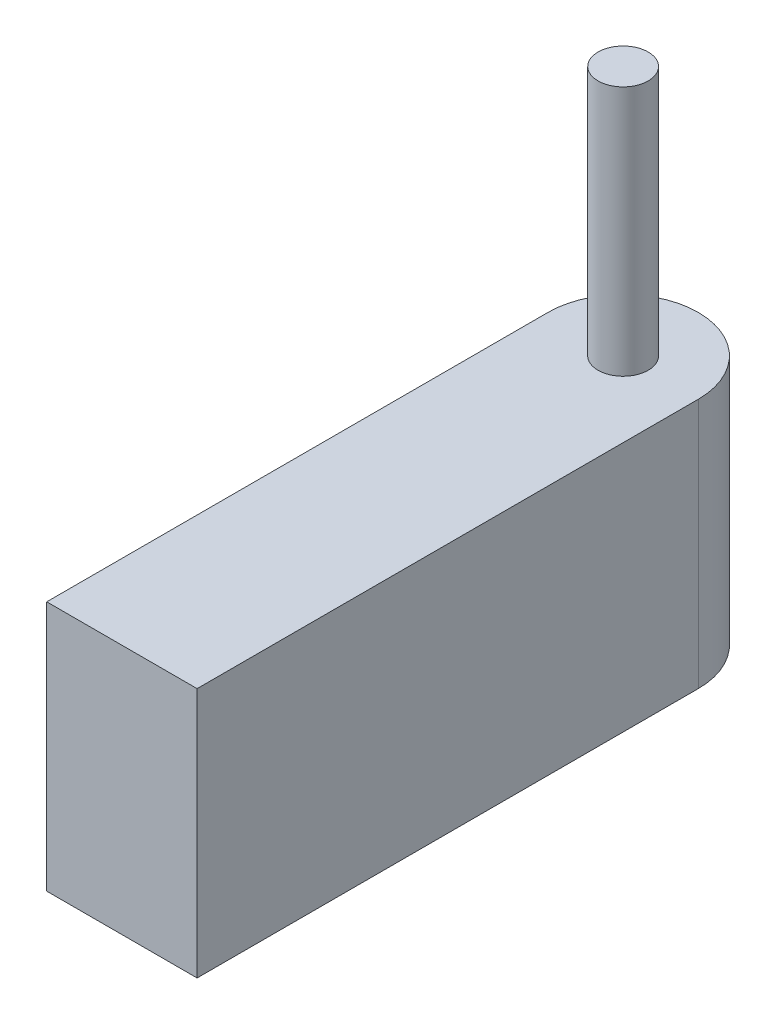
ISO-10303-21;
HEADER;
FILE_DESCRIPTION(('STEP AP214'),'2;1');
FILE_NAME('part.step','',(''),(''),'','','');
FILE_SCHEMA(('AUTOMOTIVE_DESIGN { 1 0 10303 214 1 1 1 1 }'));
ENDSEC;
DATA;
#1=APPLICATION_CONTEXT('core data for automotive mechanical design processes');
#2=APPLICATION_PROTOCOL_DEFINITION('international standard','automotive_design',2000,#1);
#3=PRODUCT_CONTEXT('',#1,'mechanical');
#4=PRODUCT('Part','Part','',(#3));
#5=PRODUCT_RELATED_PRODUCT_CATEGORY('part','',(#4));
#6=PRODUCT_DEFINITION_FORMATION('','',#4);
#7=PRODUCT_DEFINITION_CONTEXT('part definition',#1,'design');
#8=PRODUCT_DEFINITION('design','',#6,#7);
#9=PRODUCT_DEFINITION_SHAPE('','',#8);
#10=(LENGTH_UNIT() NAMED_UNIT(*) SI_UNIT(.MILLI.,.METRE.));
#11=(NAMED_UNIT(*) PLANE_ANGLE_UNIT() SI_UNIT($,.RADIAN.));
#12=(NAMED_UNIT(*) SI_UNIT($,.STERADIAN.) SOLID_ANGLE_UNIT());
#13=UNCERTAINTY_MEASURE_WITH_UNIT(LENGTH_MEASURE(1.E-05),#10,'distance_accuracy_value','');
#14=(GEOMETRIC_REPRESENTATION_CONTEXT(3) GLOBAL_UNCERTAINTY_ASSIGNED_CONTEXT((#13)) GLOBAL_UNIT_ASSIGNED_CONTEXT((#10,
#11,#12)) REPRESENTATION_CONTEXT('',''));
#15=CARTESIAN_POINT('',(0.,0.,0.));
#16=DIRECTION('',(0.,0.,1.));
#17=DIRECTION('',(1.,0.,0.));
#18=AXIS2_PLACEMENT_3D('',#15,#16,#17);
#19=CARTESIAN_POINT('',(0.,1.27,-1.27));
#20=DIRECTION('',(0.,-1.,0.));
#21=DIRECTION('',(0.,0.,-1.));
#22=AXIS2_PLACEMENT_3D('',#19,#20,#21);
#23=CYLINDRICAL_SURFACE('',#22,0.381);
#24=CARTESIAN_POINT('',(0.,0.,-1.27));
#25=DIRECTION('',(0.,1.,0.));
#26=DIRECTION('',(0.,0.,1.));
#27=AXIS2_PLACEMENT_3D('',#24,#25,#26);
#28=CIRCLE('',#27,0.381);
#29=CARTESIAN_POINT('',(0.381,0.,-1.27));
#30=VERTEX_POINT('',#29);
#31=CARTESIAN_POINT('',(-0.381,0.,-1.27));
#32=VERTEX_POINT('',#31);
#33=EDGE_CURVE('E111',#30,#32,#28,.T.);
#34=ORIENTED_EDGE('',*,*,#33,.T.);
#35=DIRECTION('',(0.,-1.,0.));
#36=VECTOR('',#35,1.);
#37=CARTESIAN_POINT('',(-0.381,1.27,-1.27));
#38=LINE('',#37,#36);
#39=CARTESIAN_POINT('',(-0.381,1.27,-1.27));
#40=VERTEX_POINT('',#39);
#41=EDGE_CURVE('E11',#40,#32,#38,.T.);
#42=ORIENTED_EDGE('',*,*,#41,.F.);
#43=CARTESIAN_POINT('',(0.,1.27,-1.27));
#44=DIRECTION('',(0.,1.,0.));
#45=DIRECTION('',(0.,0.,1.));
#46=AXIS2_PLACEMENT_3D('',#43,#44,#45);
#47=CIRCLE('',#46,0.381);
#48=CARTESIAN_POINT('',(0.381,1.27,-1.27));
#49=VERTEX_POINT('',#48);
#50=EDGE_CURVE('E84',#49,#40,#47,.T.);
#51=ORIENTED_EDGE('',*,*,#50,.F.);
#52=DIRECTION('',(0.,-1.,0.));
#53=VECTOR('',#52,1.);
#54=CARTESIAN_POINT('',(0.381,1.27,-1.27));
#55=LINE('',#54,#53);
#56=EDGE_CURVE('E110',#49,#30,#55,.T.);
#57=ORIENTED_EDGE('',*,*,#56,.T.);
#58=EDGE_LOOP('',(#34,#42,#51,#57));
#59=FACE_BOUND('',#58,.T.);
#60=ADVANCED_FACE('F41',(#59),#23,.T.);
#61=CARTESIAN_POINT('',(-0.381,1.27,0.));
#62=DIRECTION('',(-1.,0.,0.));
#63=DIRECTION('',(0.,0.,1.));
#64=AXIS2_PLACEMENT_3D('',#61,#62,#63);
#65=PLANE('',#64);
#66=DIRECTION('',(0.,0.,-1.));
#67=VECTOR('',#66,1.);
#68=CARTESIAN_POINT('',(-0.381,0.,0.));
#69=LINE('',#68,#67);
#70=CARTESIAN_POINT('',(-0.381,0.,1.27));
#71=VERTEX_POINT('',#70);
#72=EDGE_CURVE('E94',#71,#32,#69,.T.);
#73=ORIENTED_EDGE('',*,*,#72,.F.);
#74=DIRECTION('',(0.,-1.,0.));
#75=VECTOR('',#74,1.);
#76=CARTESIAN_POINT('',(-0.381,1.27,1.27));
#77=LINE('',#76,#75);
#78=CARTESIAN_POINT('',(-0.381,1.27,1.27));
#79=VERTEX_POINT('',#78);
#80=EDGE_CURVE('E50',#79,#71,#77,.T.);
#81=ORIENTED_EDGE('',*,*,#80,.F.);
#82=DIRECTION('',(0.,0.,-1.));
#83=VECTOR('',#82,1.);
#84=CARTESIAN_POINT('',(-0.381,1.27,0.));
#85=LINE('',#84,#83);
#86=EDGE_CURVE('E92',#79,#40,#85,.T.);
#87=ORIENTED_EDGE('',*,*,#86,.T.);
#88=ORIENTED_EDGE('',*,*,#41,.T.);
#89=EDGE_LOOP('',(#73,#81,#87,#88));
#90=FACE_BOUND('',#89,.T.);
#91=ADVANCED_FACE('F91',(#90),#65,.T.);
#92=CARTESIAN_POINT('',(0.,1.27,1.27));
#93=DIRECTION('',(0.,0.,-1.));
#94=DIRECTION('',(-1.,0.,0.));
#95=AXIS2_PLACEMENT_3D('',#92,#93,#94);
#96=PLANE('',#95);
#97=DIRECTION('',(1.,0.,0.));
#98=VECTOR('',#97,1.);
#99=CARTESIAN_POINT('',(0.,0.,1.27));
#100=LINE('',#99,#98);
#101=CARTESIAN_POINT('',(0.381,0.,1.27));
#102=VERTEX_POINT('',#101);
#103=EDGE_CURVE('E73',#71,#102,#100,.T.);
#104=ORIENTED_EDGE('',*,*,#103,.T.);
#105=DIRECTION('',(0.,-1.,0.));
#106=VECTOR('',#105,1.);
#107=CARTESIAN_POINT('',(0.381,1.27,1.27));
#108=LINE('',#107,#106);
#109=CARTESIAN_POINT('',(0.381,1.27,1.27));
#110=VERTEX_POINT('',#109);
#111=EDGE_CURVE('E96',#110,#102,#108,.T.);
#112=ORIENTED_EDGE('',*,*,#111,.F.);
#113=DIRECTION('',(1.,0.,0.));
#114=VECTOR('',#113,1.);
#115=CARTESIAN_POINT('',(0.,1.27,1.27));
#116=LINE('',#115,#114);
#117=EDGE_CURVE('E97',#79,#110,#116,.T.);
#118=ORIENTED_EDGE('',*,*,#117,.F.);
#119=ORIENTED_EDGE('',*,*,#80,.T.);
#120=EDGE_LOOP('',(#104,#112,#118,#119));
#121=FACE_BOUND('',#120,.T.);
#122=ADVANCED_FACE('F98',(#121),#96,.F.);
#123=CARTESIAN_POINT('',(0.381,1.27,0.));
#124=DIRECTION('',(-1.,0.,0.));
#125=DIRECTION('',(0.,0.,1.));
#126=AXIS2_PLACEMENT_3D('',#123,#124,#125);
#127=PLANE('',#126);
#128=DIRECTION('',(0.,0.,-1.));
#129=VECTOR('',#128,1.);
#130=CARTESIAN_POINT('',(0.381,0.,0.));
#131=LINE('',#130,#129);
#132=EDGE_CURVE('E79',#102,#30,#131,.T.);
#133=ORIENTED_EDGE('',*,*,#132,.T.);
#134=ORIENTED_EDGE('',*,*,#56,.F.);
#135=DIRECTION('',(0.,0.,-1.));
#136=VECTOR('',#135,1.);
#137=CARTESIAN_POINT('',(0.381,1.27,0.));
#138=LINE('',#137,#136);
#139=EDGE_CURVE('E58',#110,#49,#138,.T.);
#140=ORIENTED_EDGE('',*,*,#139,.F.);
#141=ORIENTED_EDGE('',*,*,#111,.T.);
#142=EDGE_LOOP('',(#133,#134,#140,#141));
#143=FACE_BOUND('',#142,.T.);
#144=ADVANCED_FACE('F125',(#143),#127,.F.);
#145=CARTESIAN_POINT('',(0.,1.27,0.));
#146=DIRECTION('',(0.,1.,0.));
#147=DIRECTION('',(0.,0.,1.));
#148=AXIS2_PLACEMENT_3D('',#145,#146,#147);
#149=PLANE('',#148);
#150=CARTESIAN_POINT('',(0.,1.27,-1.27));
#151=DIRECTION('',(0.,1.,0.));
#152=DIRECTION('',(0.,0.,1.));
#153=AXIS2_PLACEMENT_3D('',#150,#151,#152);
#154=CIRCLE('',#153,0.127);
#155=CARTESIAN_POINT('',(0.,1.27,-1.143));
#156=VERTEX_POINT('',#155);
#157=EDGE_CURVE('E115',#156,#156,#154,.F.);
#158=ORIENTED_EDGE('',*,*,#157,.T.);
#159=EDGE_LOOP('',(#158));
#160=FACE_BOUND('',#159,.T.);
#161=ORIENTED_EDGE('',*,*,#50,.T.);
#162=ORIENTED_EDGE('',*,*,#86,.F.);
#163=ORIENTED_EDGE('',*,*,#117,.T.);
#164=ORIENTED_EDGE('',*,*,#139,.T.);
#165=EDGE_LOOP('',(#161,#162,#163,#164));
#166=FACE_BOUND('',#165,.T.);
#167=ADVANCED_FACE('F101',(#160,#166),#149,.T.);
#168=CARTESIAN_POINT('',(0.,0.,0.));
#169=DIRECTION('',(0.,1.,0.));
#170=DIRECTION('',(0.,0.,1.));
#171=AXIS2_PLACEMENT_3D('',#168,#169,#170);
#172=PLANE('',#171);
#173=ORIENTED_EDGE('',*,*,#33,.F.);
#174=ORIENTED_EDGE('',*,*,#132,.F.);
#175=ORIENTED_EDGE('',*,*,#103,.F.);
#176=ORIENTED_EDGE('',*,*,#72,.T.);
#177=EDGE_LOOP('',(#173,#174,#175,#176));
#178=FACE_BOUND('',#177,.T.);
#179=ADVANCED_FACE('F128',(#178),#172,.F.);
#180=CARTESIAN_POINT('',(0.,2.54,-1.27));
#181=DIRECTION('',(0.,-1.,0.));
#182=DIRECTION('',(0.,0.,-1.));
#183=AXIS2_PLACEMENT_3D('',#180,#181,#182);
#184=CYLINDRICAL_SURFACE('',#183,0.127);
#185=ORIENTED_EDGE('',*,*,#157,.F.);
#186=EDGE_LOOP('',(#185));
#187=FACE_BOUND('',#186,.T.);
#188=CARTESIAN_POINT('',(0.,2.54,-1.27));
#189=DIRECTION('',(0.,1.,0.));
#190=DIRECTION('',(0.,0.,1.));
#191=AXIS2_PLACEMENT_3D('',#188,#189,#190);
#192=CIRCLE('',#191,0.127);
#193=CARTESIAN_POINT('',(0.,2.54,-1.143));
#194=VERTEX_POINT('',#193);
#195=EDGE_CURVE('E157',#194,#194,#192,.T.);
#196=ORIENTED_EDGE('',*,*,#195,.F.);
#197=EDGE_LOOP('',(#196));
#198=FACE_BOUND('',#197,.T.);
#199=ADVANCED_FACE('F143',(#187,#198),#184,.T.);
#200=CARTESIAN_POINT('',(0.,2.54,0.));
#201=DIRECTION('',(0.,1.,0.));
#202=DIRECTION('',(0.,0.,1.));
#203=AXIS2_PLACEMENT_3D('',#200,#201,#202);
#204=PLANE('',#203);
#205=ORIENTED_EDGE('',*,*,#195,.T.);
#206=EDGE_LOOP('',(#205));
#207=FACE_BOUND('',#206,.T.);
#208=ADVANCED_FACE('F149',(#207),#204,.T.);
#209=CLOSED_SHELL('',(#60,#91,#122,#144,#167,#179,#199,#208));
#210=MANIFOLD_SOLID_BREP('B2',#209);
#211=ADVANCED_BREP_SHAPE_REPRESENTATION('',(#18,#210),#14);
#212=SHAPE_DEFINITION_REPRESENTATION(#9,#211);
ENDSEC;
END-ISO-10303-21;
